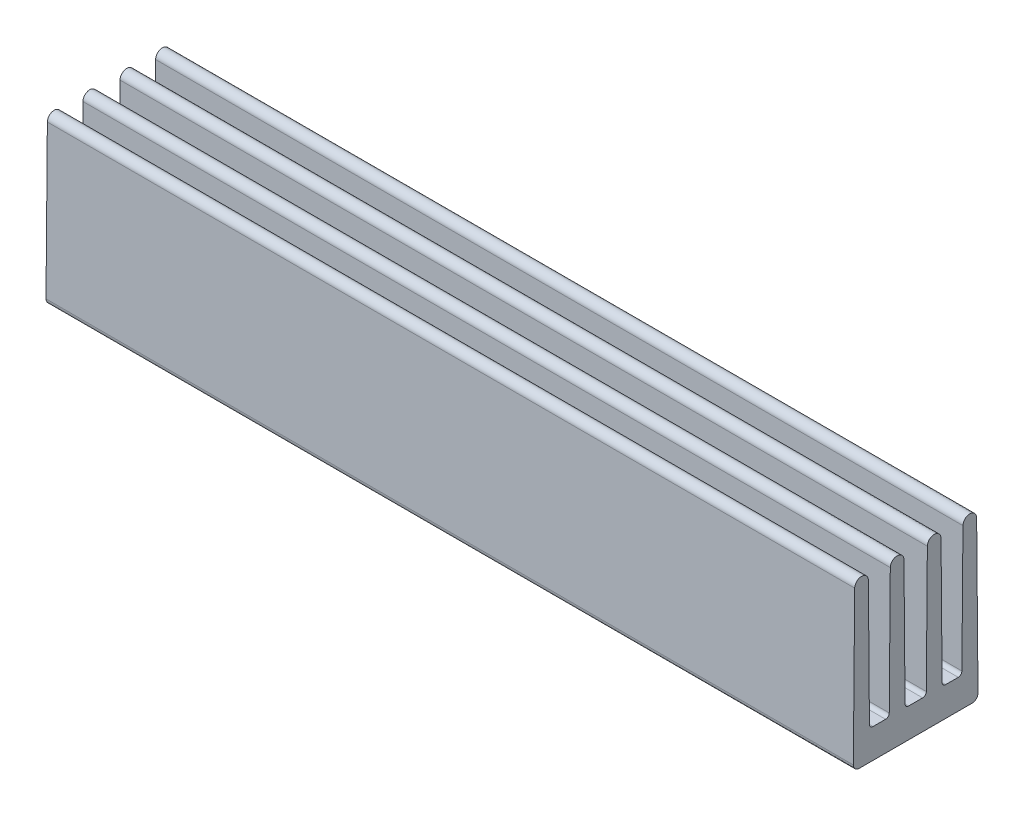
ISO-10303-21;
HEADER;
FILE_DESCRIPTION(('STEP AP214'),'2;1');
FILE_NAME('part.step','',(''),(''),'','','');
FILE_SCHEMA(('AUTOMOTIVE_DESIGN { 1 0 10303 214 1 1 1 1 }'));
ENDSEC;
DATA;
#1=APPLICATION_CONTEXT('core data for automotive mechanical design processes');
#2=APPLICATION_PROTOCOL_DEFINITION('international standard','automotive_design',2000,#1);
#3=PRODUCT_CONTEXT('',#1,'mechanical');
#4=PRODUCT('Part','Part','',(#3));
#5=PRODUCT_RELATED_PRODUCT_CATEGORY('part','',(#4));
#6=PRODUCT_DEFINITION_FORMATION('','',#4);
#7=PRODUCT_DEFINITION_CONTEXT('part definition',#1,'design');
#8=PRODUCT_DEFINITION('design','',#6,#7);
#9=PRODUCT_DEFINITION_SHAPE('','',#8);
#10=(LENGTH_UNIT() NAMED_UNIT(*) SI_UNIT(.MILLI.,.METRE.));
#11=(NAMED_UNIT(*) PLANE_ANGLE_UNIT() SI_UNIT($,.RADIAN.));
#12=(NAMED_UNIT(*) SI_UNIT($,.STERADIAN.) SOLID_ANGLE_UNIT());
#13=UNCERTAINTY_MEASURE_WITH_UNIT(LENGTH_MEASURE(1.E-05),#10,'distance_accuracy_value','');
#14=(GEOMETRIC_REPRESENTATION_CONTEXT(3) GLOBAL_UNCERTAINTY_ASSIGNED_CONTEXT((#13)) GLOBAL_UNIT_ASSIGNED_CONTEXT((#10,
#11,#12)) REPRESENTATION_CONTEXT('',''));
#15=CARTESIAN_POINT('',(0.,0.,0.));
#16=DIRECTION('',(0.,0.,1.));
#17=DIRECTION('',(1.,0.,0.));
#18=AXIS2_PLACEMENT_3D('',#15,#16,#17);
#19=CARTESIAN_POINT('',(27.5,10.7835006819347,-3.68762891330107));
#20=DIRECTION('',(1.,0.,0.));
#21=DIRECTION('',(0.,0.,-1.));
#22=AXIS2_PLACEMENT_3D('',#19,#20,#21);
#23=CYLINDRICAL_SURFACE('',#22,0.466499318065294);
#24=DIRECTION('',(1.,0.,0.));
#25=VECTOR('',#24,1.);
#26=CARTESIAN_POINT('',(-27.5,10.7873871419348,-3.22114578479153));
#27=LINE('',#26,#25);
#28=CARTESIAN_POINT('',(27.5,10.7873871419348,-3.22114578479153));
#29=VERTEX_POINT('',#28);
#30=CARTESIAN_POINT('',(-27.5,10.7873871419348,-3.22114578479153));
#31=VERTEX_POINT('',#30);
#32=EDGE_CURVE('E373',#29,#31,#27,.F.);
#33=ORIENTED_EDGE('',*,*,#32,.F.);
#34=CARTESIAN_POINT('',(27.5,10.7835006819347,-3.68762891330107));
#35=DIRECTION('',(1.,0.,0.));
#36=DIRECTION('',(0.,0.,-1.));
#37=AXIS2_PLACEMENT_3D('',#34,#35,#36);
#38=CIRCLE('',#37,0.466499318065294);
#39=CARTESIAN_POINT('',(27.5,10.7876471787307,-4.15410980285573));
#40=VERTEX_POINT('',#39);
#41=EDGE_CURVE('E379',#40,#29,#38,.T.);
#42=ORIENTED_EDGE('',*,*,#41,.F.);
#43=DIRECTION('',(1.,0.,0.));
#44=VECTOR('',#43,1.);
#45=CARTESIAN_POINT('',(27.5,10.7876471787307,-4.15410980285573));
#46=LINE('',#45,#44);
#47=CARTESIAN_POINT('',(-27.5,10.7876471787307,-4.15410980285573));
#48=VERTEX_POINT('',#47);
#49=EDGE_CURVE('E376',#48,#40,#46,.T.);
#50=ORIENTED_EDGE('',*,*,#49,.F.);
#51=CARTESIAN_POINT('',(-27.5,10.7835006819347,-3.68762891330107));
#52=DIRECTION('',(1.,0.,0.));
#53=DIRECTION('',(0.,0.,-1.));
#54=AXIS2_PLACEMENT_3D('',#51,#52,#53);
#55=CIRCLE('',#54,0.466499318065294);
#56=EDGE_CURVE('E381',#31,#48,#55,.F.);
#57=ORIENTED_EDGE('',*,*,#56,.F.);
#58=EDGE_LOOP('',(#33,#42,#50,#57));
#59=FACE_BOUND('',#58,.T.);
#60=ADVANCED_FACE('F46',(#59),#23,.T.);
#61=CARTESIAN_POINT('',(27.5,10.7836306737387,-1.2625));
#62=DIRECTION('',(1.,0.,0.));
#63=DIRECTION('',(0.,0.,-1.));
#64=AXIS2_PLACEMENT_3D('',#61,#62,#63);
#65=CYLINDRICAL_SURFACE('',#64,0.466369326261257);
#66=DIRECTION('',(1.,0.,0.));
#67=VECTOR('',#66,1.);
#68=CARTESIAN_POINT('',(-27.5,10.787516050762,-0.796146858783211));
#69=LINE('',#68,#67);
#70=CARTESIAN_POINT('',(27.5,10.787516050762,-0.796146858783211));
#71=VERTEX_POINT('',#70);
#72=CARTESIAN_POINT('',(-27.5,10.787516050762,-0.796146858783211));
#73=VERTEX_POINT('',#72);
#74=EDGE_CURVE('E363',#71,#73,#69,.F.);
#75=ORIENTED_EDGE('',*,*,#74,.F.);
#76=CARTESIAN_POINT('',(27.5,10.7836306737387,-1.2625));
#77=DIRECTION('',(1.,0.,0.));
#78=DIRECTION('',(0.,0.,-1.));
#79=AXIS2_PLACEMENT_3D('',#76,#77,#78);
#80=CIRCLE('',#79,0.466369326261257);
#81=CARTESIAN_POINT('',(27.5,10.787516050762,-1.72885314121679));
#82=VERTEX_POINT('',#81);
#83=EDGE_CURVE('E369',#82,#71,#80,.T.);
#84=ORIENTED_EDGE('',*,*,#83,.F.);
#85=DIRECTION('',(1.,0.,0.));
#86=VECTOR('',#85,1.);
#87=CARTESIAN_POINT('',(-27.5,10.787516050762,-1.72885314121679));
#88=LINE('',#87,#86);
#89=CARTESIAN_POINT('',(-27.5,10.787516050762,-1.72885314121679));
#90=VERTEX_POINT('',#89);
#91=EDGE_CURVE('E366',#90,#82,#88,.T.);
#92=ORIENTED_EDGE('',*,*,#91,.F.);
#93=CARTESIAN_POINT('',(-27.5,10.7836306737387,-1.2625));
#94=DIRECTION('',(1.,0.,0.));
#95=DIRECTION('',(0.,0.,-1.));
#96=AXIS2_PLACEMENT_3D('',#93,#94,#95);
#97=CIRCLE('',#96,0.466369326261257);
#98=EDGE_CURVE('E371',#73,#90,#97,.F.);
#99=ORIENTED_EDGE('',*,*,#98,.F.);
#100=EDGE_LOOP('',(#75,#84,#92,#99));
#101=FACE_BOUND('',#100,.T.);
#102=ADVANCED_FACE('F466',(#101),#65,.T.);
#103=CARTESIAN_POINT('',(27.5,10.7836306737387,1.2625));
#104=DIRECTION('',(1.,0.,0.));
#105=DIRECTION('',(0.,0.,-1.));
#106=AXIS2_PLACEMENT_3D('',#103,#104,#105);
#107=CYLINDRICAL_SURFACE('',#106,0.466369326261258);
#108=DIRECTION('',(1.,0.,0.));
#109=VECTOR('',#108,1.);
#110=CARTESIAN_POINT('',(-27.5,10.787516050762,1.72885314121679));
#111=LINE('',#110,#109);
#112=CARTESIAN_POINT('',(27.5,10.787516050762,1.72885314121679));
#113=VERTEX_POINT('',#112);
#114=CARTESIAN_POINT('',(-27.5,10.787516050762,1.72885314121679));
#115=VERTEX_POINT('',#114);
#116=EDGE_CURVE('E353',#113,#115,#111,.F.);
#117=ORIENTED_EDGE('',*,*,#116,.F.);
#118=CARTESIAN_POINT('',(27.5,10.7836306737387,1.2625));
#119=DIRECTION('',(1.,0.,0.));
#120=DIRECTION('',(0.,0.,-1.));
#121=AXIS2_PLACEMENT_3D('',#118,#119,#120);
#122=CIRCLE('',#121,0.466369326261258);
#123=CARTESIAN_POINT('',(27.5,10.787516050762,0.796146858783211));
#124=VERTEX_POINT('',#123);
#125=EDGE_CURVE('E359',#124,#113,#122,.T.);
#126=ORIENTED_EDGE('',*,*,#125,.F.);
#127=DIRECTION('',(1.,0.,0.));
#128=VECTOR('',#127,1.);
#129=CARTESIAN_POINT('',(-27.5,10.787516050762,0.796146858783211));
#130=LINE('',#129,#128);
#131=CARTESIAN_POINT('',(-27.5,10.787516050762,0.796146858783211));
#132=VERTEX_POINT('',#131);
#133=EDGE_CURVE('E356',#132,#124,#130,.T.);
#134=ORIENTED_EDGE('',*,*,#133,.F.);
#135=CARTESIAN_POINT('',(-27.5,10.7836306737387,1.2625));
#136=DIRECTION('',(1.,0.,0.));
#137=DIRECTION('',(0.,0.,-1.));
#138=AXIS2_PLACEMENT_3D('',#135,#136,#137);
#139=CIRCLE('',#138,0.466369326261258);
#140=EDGE_CURVE('E361',#115,#132,#139,.F.);
#141=ORIENTED_EDGE('',*,*,#140,.F.);
#142=EDGE_LOOP('',(#117,#126,#134,#141));
#143=FACE_BOUND('',#142,.T.);
#144=ADVANCED_FACE('F441',(#143),#107,.T.);
#145=CARTESIAN_POINT('',(27.5,10.7835006819347,3.68762891330107));
#146=DIRECTION('',(-1.,0.,0.));
#147=DIRECTION('',(0.,0.,1.));
#148=AXIS2_PLACEMENT_3D('',#145,#146,#147);
#149=CYLINDRICAL_SURFACE('',#148,0.466499318065293);
#150=DIRECTION('',(-1.,0.,0.));
#151=VECTOR('',#150,1.);
#152=CARTESIAN_POINT('',(27.5,10.7876471787307,4.15410980285573));
#153=LINE('',#152,#151);
#154=CARTESIAN_POINT('',(27.5,10.7876471787307,4.15410980285573));
#155=VERTEX_POINT('',#154);
#156=CARTESIAN_POINT('',(-27.5,10.7876471787307,4.15410980285573));
#157=VERTEX_POINT('',#156);
#158=EDGE_CURVE('E339',#155,#157,#153,.T.);
#159=ORIENTED_EDGE('',*,*,#158,.F.);
#160=CARTESIAN_POINT('',(27.5,10.7835006819347,3.68762891330107));
#161=DIRECTION('',(1.,0.,0.));
#162=DIRECTION('',(0.,0.,-1.));
#163=AXIS2_PLACEMENT_3D('',#160,#161,#162);
#164=CIRCLE('',#163,0.466499318065293);
#165=CARTESIAN_POINT('',(27.5,10.7873871419348,3.22114578479153));
#166=VERTEX_POINT('',#165);
#167=EDGE_CURVE('E349',#166,#155,#164,.T.);
#168=ORIENTED_EDGE('',*,*,#167,.F.);
#169=DIRECTION('',(-1.,0.,0.));
#170=VECTOR('',#169,1.);
#171=CARTESIAN_POINT('',(-27.5,10.7873871419348,3.22114578479153));
#172=LINE('',#171,#170);
#173=CARTESIAN_POINT('',(-27.5,10.7873871419348,3.22114578479153));
#174=VERTEX_POINT('',#173);
#175=EDGE_CURVE('E346',#174,#166,#172,.F.);
#176=ORIENTED_EDGE('',*,*,#175,.F.);
#177=CARTESIAN_POINT('',(-27.5,10.7835006819347,3.68762891330107));
#178=DIRECTION('',(1.,0.,0.));
#179=DIRECTION('',(0.,0.,-1.));
#180=AXIS2_PLACEMENT_3D('',#177,#178,#179);
#181=CIRCLE('',#180,0.466499318065293);
#182=EDGE_CURVE('E351',#157,#174,#181,.F.);
#183=ORIENTED_EDGE('',*,*,#182,.F.);
#184=EDGE_LOOP('',(#159,#168,#176,#183));
#185=FACE_BOUND('',#184,.T.);
#186=ADVANCED_FACE('F416',(#185),#149,.T.);
#187=CARTESIAN_POINT('',(27.5,11.25,4.15));
#188=DIRECTION('',(0.,-0.00888853774371659,-0.999960496168113));
#189=DIRECTION('',(0.,0.999960496168113,-0.00888853774371659));
#190=AXIS2_PLACEMENT_3D('',#187,#188,#189);
#191=PLANE('',#190);
#192=DIRECTION('',(0.,-0.999960496168113,0.00888853774371659));
#193=VECTOR('',#192,1.);
#194=CARTESIAN_POINT('',(-27.5,11.25,4.15));
#195=LINE('',#194,#193);
#196=CARTESIAN_POINT('',(-27.5,0.403555415097484,4.24641284075469));
#197=VERTEX_POINT('',#196);
#198=EDGE_CURVE('E325',#157,#197,#195,.T.);
#199=ORIENTED_EDGE('',*,*,#198,.T.);
#200=DIRECTION('',(-1.,0.,0.));
#201=VECTOR('',#200,1.);
#202=CARTESIAN_POINT('',(27.5,0.403555415097486,4.24641284075469));
#203=LINE('',#202,#201);
#204=CARTESIAN_POINT('',(27.5,0.403555415097484,4.24641284075469));
#205=VERTEX_POINT('',#204);
#206=EDGE_CURVE('E12',#197,#205,#203,.F.);
#207=ORIENTED_EDGE('',*,*,#206,.T.);
#208=DIRECTION('',(0.,-0.999960496168113,0.00888853774371659));
#209=VECTOR('',#208,1.);
#210=CARTESIAN_POINT('',(27.5,11.25,4.15));
#211=LINE('',#210,#209);
#212=EDGE_CURVE('E332',#155,#205,#211,.T.);
#213=ORIENTED_EDGE('',*,*,#212,.F.);
#214=ORIENTED_EDGE('',*,*,#158,.T.);
#215=EDGE_LOOP('',(#199,#207,#213,#214));
#216=FACE_BOUND('',#215,.T.);
#217=ADVANCED_FACE('F413',(#216),#191,.F.);
#218=CARTESIAN_POINT('',(27.5,0.,4.25));
#219=DIRECTION('',(0.,1.,0.));
#220=DIRECTION('',(0.,0.,1.));
#221=AXIS2_PLACEMENT_3D('',#218,#219,#220);
#222=PLANE('',#221);
#223=DIRECTION('',(0.,0.,-1.));
#224=VECTOR('',#223,1.);
#225=CARTESIAN_POINT('',(-27.5,0.,4.25));
#226=LINE('',#225,#224);
#227=CARTESIAN_POINT('',(-27.5,0.,3.84642864228744));
#228=VERTEX_POINT('',#227);
#229=CARTESIAN_POINT('',(-27.5,0.,-3.84642864228744));
#230=VERTEX_POINT('',#229);
#231=EDGE_CURVE('E341',#228,#230,#226,.T.);
#232=ORIENTED_EDGE('',*,*,#231,.T.);
#233=DIRECTION('',(-1.,0.,0.));
#234=VECTOR('',#233,1.);
#235=CARTESIAN_POINT('',(27.5,0.,-3.84642864228744));
#236=LINE('',#235,#234);
#237=CARTESIAN_POINT('',(27.5,0.,-3.84642864228744));
#238=VERTEX_POINT('',#237);
#239=EDGE_CURVE('E67',#230,#238,#236,.F.);
#240=ORIENTED_EDGE('',*,*,#239,.T.);
#241=DIRECTION('',(0.,0.,-1.));
#242=VECTOR('',#241,1.);
#243=CARTESIAN_POINT('',(27.5,0.,4.25));
#244=LINE('',#243,#242);
#245=CARTESIAN_POINT('',(27.5,0.,3.84642864228744));
#246=VERTEX_POINT('',#245);
#247=EDGE_CURVE('E334',#246,#238,#244,.T.);
#248=ORIENTED_EDGE('',*,*,#247,.F.);
#249=DIRECTION('',(-1.,0.,0.));
#250=VECTOR('',#249,1.);
#251=CARTESIAN_POINT('',(27.5,0.,3.84642864228744));
#252=LINE('',#251,#250);
#253=EDGE_CURVE('E391',#246,#228,#252,.T.);
#254=ORIENTED_EDGE('',*,*,#253,.T.);
#255=EDGE_LOOP('',(#232,#240,#248,#254));
#256=FACE_BOUND('',#255,.T.);
#257=ADVANCED_FACE('F408',(#256),#222,.F.);
#258=CARTESIAN_POINT('',(27.5,0.,-4.25));
#259=DIRECTION('',(0.,-0.00888853774371659,0.999960496168113));
#260=DIRECTION('',(0.,-0.999960496168113,-0.00888853774371659));
#261=AXIS2_PLACEMENT_3D('',#258,#259,#260);
#262=PLANE('',#261);
#263=DIRECTION('',(0.,0.999960496168113,0.00888853774371659));
#264=VECTOR('',#263,1.);
#265=CARTESIAN_POINT('',(27.5,0.,-4.25));
#266=LINE('',#265,#264);
#267=CARTESIAN_POINT('',(27.5,0.403555415097487,-4.24641284075469));
#268=VERTEX_POINT('',#267);
#269=EDGE_CURVE('E337',#268,#40,#266,.T.);
#270=ORIENTED_EDGE('',*,*,#269,.F.);
#271=DIRECTION('',(-1.,0.,0.));
#272=VECTOR('',#271,1.);
#273=CARTESIAN_POINT('',(27.5,0.403555415097487,-4.24641284075469));
#274=LINE('',#273,#272);
#275=CARTESIAN_POINT('',(-27.5,0.403555415097487,-4.24641284075469));
#276=VERTEX_POINT('',#275);
#277=EDGE_CURVE('E384',#268,#276,#274,.T.);
#278=ORIENTED_EDGE('',*,*,#277,.T.);
#279=DIRECTION('',(0.,0.999960496168113,0.00888853774371659));
#280=VECTOR('',#279,1.);
#281=CARTESIAN_POINT('',(-27.5,0.,-4.25));
#282=LINE('',#281,#280);
#283=EDGE_CURVE('E335',#276,#48,#282,.T.);
#284=ORIENTED_EDGE('',*,*,#283,.T.);
#285=ORIENTED_EDGE('',*,*,#49,.T.);
#286=EDGE_LOOP('',(#270,#278,#284,#285));
#287=FACE_BOUND('',#286,.T.);
#288=ADVANCED_FACE('F404',(#287),#262,.F.);
#289=CARTESIAN_POINT('',(27.5,0.,0.));
#290=DIRECTION('',(1.,0.,0.));
#291=DIRECTION('',(0.,0.,-1.));
#292=AXIS2_PLACEMENT_3D('',#289,#290,#291);
#293=PLANE('',#292);
#294=ORIENTED_EDGE('',*,*,#247,.T.);
#295=CARTESIAN_POINT('',(27.5,0.4,-3.84642864228744));
#296=DIRECTION('',(1.,0.,0.));
#297=DIRECTION('',(0.,0.,-1.));
#298=AXIS2_PLACEMENT_3D('',#295,#296,#297);
#299=CIRCLE('',#298,0.4);
#300=EDGE_CURVE('E54',#238,#268,#299,.T.);
#301=ORIENTED_EDGE('',*,*,#300,.T.);
#302=ORIENTED_EDGE('',*,*,#269,.T.);
#303=ORIENTED_EDGE('',*,*,#41,.T.);
#304=DIRECTION('',(0.,0.999965295649698,-0.00833111614440842));
#305=VECTOR('',#304,1.);
#306=CARTESIAN_POINT('',(27.5,2.2479172209639,-3.15));
#307=LINE('',#306,#305);
#308=CARTESIAN_POINT('',(27.5,2.2479172209639,-3.15));
#309=VERTEX_POINT('',#308);
#310=EDGE_CURVE('E242',#309,#29,#307,.T.);
#311=ORIENTED_EDGE('',*,*,#310,.F.);
#312=CARTESIAN_POINT('',(27.5,2.25,-2.90000867608757));
#313=DIRECTION('',(1.,0.,0.));
#314=DIRECTION('',(0.,0.,-1.));
#315=AXIS2_PLACEMENT_3D('',#312,#313,#314);
#316=CIRCLE('',#315,0.25);
#317=CARTESIAN_POINT('',(27.5,2.,-2.90000867608757));
#318=VERTEX_POINT('',#317);
#319=EDGE_CURVE('E250',#318,#309,#316,.T.);
#320=ORIENTED_EDGE('',*,*,#319,.F.);
#321=DIRECTION('',(0.,0.,-1.));
#322=VECTOR('',#321,1.);
#323=CARTESIAN_POINT('',(27.5,2.,-2.04999132391243));
#324=LINE('',#323,#322);
#325=CARTESIAN_POINT('',(27.5,2.,-2.04999132391243));
#326=VERTEX_POINT('',#325);
#327=EDGE_CURVE('E248',#326,#318,#324,.T.);
#328=ORIENTED_EDGE('',*,*,#327,.F.);
#329=CARTESIAN_POINT('',(27.5,2.25,-2.04999132391243));
#330=DIRECTION('',(1.,0.,0.));
#331=DIRECTION('',(0.,0.,-1.));
#332=AXIS2_PLACEMENT_3D('',#329,#330,#331);
#333=CIRCLE('',#332,0.25);
#334=CARTESIAN_POINT('',(27.5,2.2479172209639,-1.8));
#335=VERTEX_POINT('',#334);
#336=EDGE_CURVE('E217',#335,#326,#333,.T.);
#337=ORIENTED_EDGE('',*,*,#336,.F.);
#338=DIRECTION('',(0.,-0.999965295649698,-0.00833111614440842));
#339=VECTOR('',#338,1.);
#340=CARTESIAN_POINT('',(27.5,11.25,-1.725));
#341=LINE('',#340,#339);
#342=EDGE_CURVE('E245',#82,#335,#341,.T.);
#343=ORIENTED_EDGE('',*,*,#342,.F.);
#344=ORIENTED_EDGE('',*,*,#83,.T.);
#345=DIRECTION('',(0.,0.999965295649698,-0.0083311161444083));
#346=VECTOR('',#345,1.);
#347=CARTESIAN_POINT('',(27.5,2.2479172209639,-0.725));
#348=LINE('',#347,#346);
#349=CARTESIAN_POINT('',(27.5,2.2479172209639,-0.725));
#350=VERTEX_POINT('',#349);
#351=EDGE_CURVE('E298',#350,#71,#348,.T.);
#352=ORIENTED_EDGE('',*,*,#351,.F.);
#353=CARTESIAN_POINT('',(27.5,2.25,-0.475008676087575));
#354=DIRECTION('',(1.,0.,0.));
#355=DIRECTION('',(0.,0.,-1.));
#356=AXIS2_PLACEMENT_3D('',#353,#354,#355);
#357=CIRCLE('',#356,0.25);
#358=CARTESIAN_POINT('',(27.5,2.,-0.475008676087575));
#359=VERTEX_POINT('',#358);
#360=EDGE_CURVE('E318',#359,#350,#357,.T.);
#361=ORIENTED_EDGE('',*,*,#360,.F.);
#362=DIRECTION('',(0.,0.,-1.));
#363=VECTOR('',#362,1.);
#364=CARTESIAN_POINT('',(27.5,2.,0.475008676087575));
#365=LINE('',#364,#363);
#366=CARTESIAN_POINT('',(27.5,2.,0.475008676087575));
#367=VERTEX_POINT('',#366);
#368=EDGE_CURVE('E315',#367,#359,#365,.T.);
#369=ORIENTED_EDGE('',*,*,#368,.F.);
#370=CARTESIAN_POINT('',(27.5,2.25,0.475008676087575));
#371=DIRECTION('',(1.,0.,0.));
#372=DIRECTION('',(0.,0.,-1.));
#373=AXIS2_PLACEMENT_3D('',#370,#371,#372);
#374=CIRCLE('',#373,0.25);
#375=CARTESIAN_POINT('',(27.5,2.2479172209639,0.725));
#376=VERTEX_POINT('',#375);
#377=EDGE_CURVE('E312',#376,#367,#374,.T.);
#378=ORIENTED_EDGE('',*,*,#377,.F.);
#379=DIRECTION('',(0.,-0.999965295649698,-0.00833111614440827));
#380=VECTOR('',#379,1.);
#381=CARTESIAN_POINT('',(27.5,11.25,0.8));
#382=LINE('',#381,#380);
#383=EDGE_CURVE('E288',#124,#376,#382,.T.);
#384=ORIENTED_EDGE('',*,*,#383,.F.);
#385=ORIENTED_EDGE('',*,*,#125,.T.);
#386=DIRECTION('',(0.,0.999965295649698,-0.00833111614440842));
#387=VECTOR('',#386,1.);
#388=CARTESIAN_POINT('',(27.5,11.25,1.725));
#389=LINE('',#388,#387);
#390=CARTESIAN_POINT('',(27.5,2.2479172209639,1.8));
#391=VERTEX_POINT('',#390);
#392=EDGE_CURVE('E261',#391,#113,#389,.T.);
#393=ORIENTED_EDGE('',*,*,#392,.F.);
#394=CARTESIAN_POINT('',(27.5,2.25,2.04999132391243));
#395=DIRECTION('',(1.,0.,0.));
#396=DIRECTION('',(0.,0.,1.));
#397=AXIS2_PLACEMENT_3D('',#394,#395,#396);
#398=CIRCLE('',#397,0.25);
#399=CARTESIAN_POINT('',(27.5,2.,2.04999132391243));
#400=VERTEX_POINT('',#399);
#401=EDGE_CURVE('E281',#400,#391,#398,.T.);
#402=ORIENTED_EDGE('',*,*,#401,.F.);
#403=DIRECTION('',(0.,0.,-1.));
#404=VECTOR('',#403,1.);
#405=CARTESIAN_POINT('',(27.5,2.,2.04999132391243));
#406=LINE('',#405,#404);
#407=CARTESIAN_POINT('',(27.5,2.,2.90000867608757));
#408=VERTEX_POINT('',#407);
#409=EDGE_CURVE('E278',#408,#400,#406,.T.);
#410=ORIENTED_EDGE('',*,*,#409,.F.);
#411=CARTESIAN_POINT('',(27.5,2.25,2.90000867608757));
#412=DIRECTION('',(1.,0.,0.));
#413=DIRECTION('',(0.,0.,1.));
#414=AXIS2_PLACEMENT_3D('',#411,#412,#413);
#415=CIRCLE('',#414,0.25);
#416=CARTESIAN_POINT('',(27.5,2.2479172209639,3.15));
#417=VERTEX_POINT('',#416);
#418=EDGE_CURVE('E275',#417,#408,#415,.T.);
#419=ORIENTED_EDGE('',*,*,#418,.F.);
#420=DIRECTION('',(0.,-0.999965295649698,-0.00833111614440842));
#421=VECTOR('',#420,1.);
#422=CARTESIAN_POINT('',(27.5,2.2479172209639,3.15));
#423=LINE('',#422,#421);
#424=EDGE_CURVE('E255',#166,#417,#423,.T.);
#425=ORIENTED_EDGE('',*,*,#424,.F.);
#426=ORIENTED_EDGE('',*,*,#167,.T.);
#427=ORIENTED_EDGE('',*,*,#212,.T.);
#428=CARTESIAN_POINT('',(27.5,0.4,3.84642864228744));
#429=DIRECTION('',(1.,0.,0.));
#430=DIRECTION('',(0.,0.,-1.));
#431=AXIS2_PLACEMENT_3D('',#428,#429,#430);
#432=CIRCLE('',#431,0.4);
#433=EDGE_CURVE('E395',#205,#246,#432,.T.);
#434=ORIENTED_EDGE('',*,*,#433,.T.);
#435=EDGE_LOOP('',(#294,#301,#302,#303,#311,#320,#328,#337,#343,#344,#352,#361,#369,#378,#384,
#385,#393,#402,#410,#419,#425,#426,#427,#434));
#436=FACE_BOUND('',#435,.T.);
#437=ADVANCED_FACE('F399',(#436),#293,.T.);
#438=CARTESIAN_POINT('',(-27.5,0.,0.));
#439=DIRECTION('',(1.,0.,0.));
#440=DIRECTION('',(0.,0.,-1.));
#441=AXIS2_PLACEMENT_3D('',#438,#439,#440);
#442=PLANE('',#441);
#443=ORIENTED_EDGE('',*,*,#283,.F.);
#444=CARTESIAN_POINT('',(-27.5,0.4,-3.84642864228744));
#445=DIRECTION('',(1.,0.,0.));
#446=DIRECTION('',(0.,0.,-1.));
#447=AXIS2_PLACEMENT_3D('',#444,#445,#446);
#448=CIRCLE('',#447,0.4);
#449=EDGE_CURVE('E389',#276,#230,#448,.F.);
#450=ORIENTED_EDGE('',*,*,#449,.T.);
#451=ORIENTED_EDGE('',*,*,#231,.F.);
#452=CARTESIAN_POINT('',(-27.5,0.4,3.84642864228744));
#453=DIRECTION('',(1.,0.,0.));
#454=DIRECTION('',(0.,0.,-1.));
#455=AXIS2_PLACEMENT_3D('',#452,#453,#454);
#456=CIRCLE('',#455,0.4);
#457=EDGE_CURVE('E387',#228,#197,#456,.F.);
#458=ORIENTED_EDGE('',*,*,#457,.T.);
#459=ORIENTED_EDGE('',*,*,#198,.F.);
#460=ORIENTED_EDGE('',*,*,#182,.T.);
#461=DIRECTION('',(0.,-0.999965295649698,-0.00833111614440842));
#462=VECTOR('',#461,1.);
#463=CARTESIAN_POINT('',(-27.5,2.2479172209639,3.15));
#464=LINE('',#463,#462);
#465=CARTESIAN_POINT('',(-27.5,2.2479172209639,3.15));
#466=VERTEX_POINT('',#465);
#467=EDGE_CURVE('E258',#174,#466,#464,.T.);
#468=ORIENTED_EDGE('',*,*,#467,.T.);
#469=CARTESIAN_POINT('',(-27.5,2.25,2.90000867608757));
#470=DIRECTION('',(1.,0.,0.));
#471=DIRECTION('',(0.,0.,1.));
#472=AXIS2_PLACEMENT_3D('',#469,#470,#471);
#473=CIRCLE('',#472,0.25);
#474=CARTESIAN_POINT('',(-27.5,2.,2.90000867608757));
#475=VERTEX_POINT('',#474);
#476=EDGE_CURVE('E260',#466,#475,#473,.T.);
#477=ORIENTED_EDGE('',*,*,#476,.T.);
#478=DIRECTION('',(0.,0.,-1.));
#479=VECTOR('',#478,1.);
#480=CARTESIAN_POINT('',(-27.5,2.,2.04999132391243));
#481=LINE('',#480,#479);
#482=CARTESIAN_POINT('',(-27.5,2.,2.04999132391243));
#483=VERTEX_POINT('',#482);
#484=EDGE_CURVE('E264',#475,#483,#481,.T.);
#485=ORIENTED_EDGE('',*,*,#484,.T.);
#486=CARTESIAN_POINT('',(-27.5,2.25,2.04999132391243));
#487=DIRECTION('',(1.,0.,0.));
#488=DIRECTION('',(0.,0.,1.));
#489=AXIS2_PLACEMENT_3D('',#486,#487,#488);
#490=CIRCLE('',#489,0.25);
#491=CARTESIAN_POINT('',(-27.5,2.2479172209639,1.8));
#492=VERTEX_POINT('',#491);
#493=EDGE_CURVE('E267',#483,#492,#490,.T.);
#494=ORIENTED_EDGE('',*,*,#493,.T.);
#495=DIRECTION('',(0.,0.999965295649698,-0.00833111614440842));
#496=VECTOR('',#495,1.);
#497=CARTESIAN_POINT('',(-27.5,11.25,1.725));
#498=LINE('',#497,#496);
#499=EDGE_CURVE('E270',#492,#115,#498,.T.);
#500=ORIENTED_EDGE('',*,*,#499,.T.);
#501=ORIENTED_EDGE('',*,*,#140,.T.);
#502=DIRECTION('',(0.,-0.999965295649698,-0.00833111614440827));
#503=VECTOR('',#502,1.);
#504=CARTESIAN_POINT('',(-27.5,11.25,0.8));
#505=LINE('',#504,#503);
#506=CARTESIAN_POINT('',(-27.5,2.2479172209639,0.725));
#507=VERTEX_POINT('',#506);
#508=EDGE_CURVE('E295',#132,#507,#505,.T.);
#509=ORIENTED_EDGE('',*,*,#508,.T.);
#510=CARTESIAN_POINT('',(-27.5,2.25,0.475008676087575));
#511=DIRECTION('',(1.,0.,0.));
#512=DIRECTION('',(0.,0.,-1.));
#513=AXIS2_PLACEMENT_3D('',#510,#511,#512);
#514=CIRCLE('',#513,0.25);
#515=CARTESIAN_POINT('',(-27.5,2.,0.475008676087575));
#516=VERTEX_POINT('',#515);
#517=EDGE_CURVE('E297',#507,#516,#514,.T.);
#518=ORIENTED_EDGE('',*,*,#517,.T.);
#519=DIRECTION('',(0.,0.,-1.));
#520=VECTOR('',#519,1.);
#521=CARTESIAN_POINT('',(-27.5,2.,0.475008676087575));
#522=LINE('',#521,#520);
#523=CARTESIAN_POINT('',(-27.5,2.,-0.475008676087575));
#524=VERTEX_POINT('',#523);
#525=EDGE_CURVE('E301',#516,#524,#522,.T.);
#526=ORIENTED_EDGE('',*,*,#525,.T.);
#527=CARTESIAN_POINT('',(-27.5,2.25,-0.475008676087575));
#528=DIRECTION('',(1.,0.,0.));
#529=DIRECTION('',(0.,0.,-1.));
#530=AXIS2_PLACEMENT_3D('',#527,#528,#529);
#531=CIRCLE('',#530,0.25);
#532=CARTESIAN_POINT('',(-27.5,2.2479172209639,-0.725));
#533=VERTEX_POINT('',#532);
#534=EDGE_CURVE('E304',#524,#533,#531,.T.);
#535=ORIENTED_EDGE('',*,*,#534,.T.);
#536=DIRECTION('',(0.,0.999965295649698,-0.0083311161444083));
#537=VECTOR('',#536,1.);
#538=CARTESIAN_POINT('',(-27.5,2.2479172209639,-0.725));
#539=LINE('',#538,#537);
#540=EDGE_CURVE('E307',#533,#73,#539,.T.);
#541=ORIENTED_EDGE('',*,*,#540,.T.);
#542=ORIENTED_EDGE('',*,*,#98,.T.);
#543=DIRECTION('',(0.,-0.999965295649698,-0.00833111614440842));
#544=VECTOR('',#543,1.);
#545=CARTESIAN_POINT('',(-27.5,11.25,-1.725));
#546=LINE('',#545,#544);
#547=CARTESIAN_POINT('',(-27.5,2.2479172209639,-1.8));
#548=VERTEX_POINT('',#547);
#549=EDGE_CURVE('E235',#90,#548,#546,.T.);
#550=ORIENTED_EDGE('',*,*,#549,.T.);
#551=CARTESIAN_POINT('',(-27.5,2.25,-2.04999132391243));
#552=DIRECTION('',(1.,0.,0.));
#553=DIRECTION('',(0.,0.,-1.));
#554=AXIS2_PLACEMENT_3D('',#551,#552,#553);
#555=CIRCLE('',#554,0.25);
#556=CARTESIAN_POINT('',(-27.5,2.,-2.04999132391243));
#557=VERTEX_POINT('',#556);
#558=EDGE_CURVE('E214',#548,#557,#555,.T.);
#559=ORIENTED_EDGE('',*,*,#558,.T.);
#560=DIRECTION('',(0.,0.,-1.));
#561=VECTOR('',#560,1.);
#562=CARTESIAN_POINT('',(-27.5,2.,-2.04999132391243));
#563=LINE('',#562,#561);
#564=CARTESIAN_POINT('',(-27.5,2.,-2.90000867608757));
#565=VERTEX_POINT('',#564);
#566=EDGE_CURVE('E225',#557,#565,#563,.T.);
#567=ORIENTED_EDGE('',*,*,#566,.T.);
#568=CARTESIAN_POINT('',(-27.5,2.25,-2.90000867608757));
#569=DIRECTION('',(1.,0.,0.));
#570=DIRECTION('',(0.,0.,-1.));
#571=AXIS2_PLACEMENT_3D('',#568,#569,#570);
#572=CIRCLE('',#571,0.25);
#573=CARTESIAN_POINT('',(-27.5,2.2479172209639,-3.15));
#574=VERTEX_POINT('',#573);
#575=EDGE_CURVE('E230',#565,#574,#572,.T.);
#576=ORIENTED_EDGE('',*,*,#575,.T.);
#577=DIRECTION('',(0.,0.999965295649698,-0.00833111614440842));
#578=VECTOR('',#577,1.);
#579=CARTESIAN_POINT('',(-27.5,2.2479172209639,-3.15));
#580=LINE('',#579,#578);
#581=EDGE_CURVE('E237',#574,#31,#580,.T.);
#582=ORIENTED_EDGE('',*,*,#581,.T.);
#583=ORIENTED_EDGE('',*,*,#56,.T.);
#584=EDGE_LOOP('',(#443,#450,#451,#458,#459,#460,#468,#477,#485,#494,#500,#501,#509,#518,#526,
#535,#541,#542,#550,#559,#567,#576,#582,#583));
#585=FACE_BOUND('',#584,.T.);
#586=ADVANCED_FACE('F233',(#585),#442,.F.);
#587=CARTESIAN_POINT('',(-27.5,2.2479172209639,-0.725));
#588=DIRECTION('',(0.,-0.0083311161444083,-0.999965295649698));
#589=DIRECTION('',(0.,0.999965295649698,-0.0083311161444083));
#590=AXIS2_PLACEMENT_3D('',#587,#588,#589);
#591=PLANE('',#590);
#592=ORIENTED_EDGE('',*,*,#351,.T.);
#593=ORIENTED_EDGE('',*,*,#74,.T.);
#594=ORIENTED_EDGE('',*,*,#540,.F.);
#595=DIRECTION('',(1.,0.,0.));
#596=VECTOR('',#595,1.);
#597=CARTESIAN_POINT('',(-27.5,2.2479172209639,-0.725));
#598=LINE('',#597,#596);
#599=EDGE_CURVE('E323',#533,#350,#598,.T.);
#600=ORIENTED_EDGE('',*,*,#599,.T.);
#601=EDGE_LOOP('',(#592,#593,#594,#600));
#602=FACE_BOUND('',#601,.T.);
#603=ADVANCED_FACE('F463',(#602),#591,.F.);
#604=CARTESIAN_POINT('',(-27.5,2.25,-0.475008676087575));
#605=DIRECTION('',(1.,0.,0.));
#606=DIRECTION('',(0.,0.,-1.));
#607=AXIS2_PLACEMENT_3D('',#604,#605,#606);
#608=CYLINDRICAL_SURFACE('',#607,0.25);
#609=ORIENTED_EDGE('',*,*,#360,.T.);
#610=ORIENTED_EDGE('',*,*,#599,.F.);
#611=ORIENTED_EDGE('',*,*,#534,.F.);
#612=DIRECTION('',(1.,0.,0.));
#613=VECTOR('',#612,1.);
#614=CARTESIAN_POINT('',(-27.5,2.,-0.475008676087575));
#615=LINE('',#614,#613);
#616=EDGE_CURVE('E326',#524,#359,#615,.T.);
#617=ORIENTED_EDGE('',*,*,#616,.T.);
#618=EDGE_LOOP('',(#609,#610,#611,#617));
#619=FACE_BOUND('',#618,.T.);
#620=ADVANCED_FACE('F461',(#619),#608,.F.);
#621=CARTESIAN_POINT('',(-27.5,2.,0.475008676087575));
#622=DIRECTION('',(0.,-1.,0.));
#623=DIRECTION('',(0.,0.,-1.));
#624=AXIS2_PLACEMENT_3D('',#621,#622,#623);
#625=PLANE('',#624);
#626=ORIENTED_EDGE('',*,*,#368,.T.);
#627=ORIENTED_EDGE('',*,*,#616,.F.);
#628=ORIENTED_EDGE('',*,*,#525,.F.);
#629=DIRECTION('',(1.,0.,0.));
#630=VECTOR('',#629,1.);
#631=CARTESIAN_POINT('',(-27.5,2.,0.475008676087575));
#632=LINE('',#631,#630);
#633=EDGE_CURVE('E328',#516,#367,#632,.T.);
#634=ORIENTED_EDGE('',*,*,#633,.T.);
#635=EDGE_LOOP('',(#626,#627,#628,#634));
#636=FACE_BOUND('',#635,.T.);
#637=ADVANCED_FACE('F457',(#636),#625,.F.);
#638=CARTESIAN_POINT('',(-27.5,2.25,0.475008676087575));
#639=DIRECTION('',(1.,0.,0.));
#640=DIRECTION('',(0.,0.,-1.));
#641=AXIS2_PLACEMENT_3D('',#638,#639,#640);
#642=CYLINDRICAL_SURFACE('',#641,0.25);
#643=ORIENTED_EDGE('',*,*,#377,.T.);
#644=ORIENTED_EDGE('',*,*,#633,.F.);
#645=ORIENTED_EDGE('',*,*,#517,.F.);
#646=DIRECTION('',(1.,0.,0.));
#647=VECTOR('',#646,1.);
#648=CARTESIAN_POINT('',(-27.5,2.2479172209639,0.725));
#649=LINE('',#648,#647);
#650=EDGE_CURVE('E310',#507,#376,#649,.T.);
#651=ORIENTED_EDGE('',*,*,#650,.T.);
#652=EDGE_LOOP('',(#643,#644,#645,#651));
#653=FACE_BOUND('',#652,.T.);
#654=ADVANCED_FACE('F448',(#653),#642,.F.);
#655=CARTESIAN_POINT('',(-27.5,11.25,0.8));
#656=DIRECTION('',(0.,-0.00833111614440827,0.999965295649698));
#657=DIRECTION('',(0.,-0.999965295649698,-0.00833111614440827));
#658=AXIS2_PLACEMENT_3D('',#655,#656,#657);
#659=PLANE('',#658);
#660=ORIENTED_EDGE('',*,*,#508,.F.);
#661=ORIENTED_EDGE('',*,*,#133,.T.);
#662=ORIENTED_EDGE('',*,*,#383,.T.);
#663=ORIENTED_EDGE('',*,*,#650,.F.);
#664=EDGE_LOOP('',(#660,#661,#662,#663));
#665=FACE_BOUND('',#664,.T.);
#666=ADVANCED_FACE('F451',(#665),#659,.F.);
#667=CARTESIAN_POINT('',(-27.5,2.2479172209639,3.15));
#668=DIRECTION('',(0.,-0.00833111614440842,0.999965295649698));
#669=DIRECTION('',(0.,-0.999965295649698,-0.00833111614440842));
#670=AXIS2_PLACEMENT_3D('',#667,#668,#669);
#671=PLANE('',#670);
#672=ORIENTED_EDGE('',*,*,#467,.F.);
#673=ORIENTED_EDGE('',*,*,#175,.T.);
#674=ORIENTED_EDGE('',*,*,#424,.T.);
#675=DIRECTION('',(1.,0.,0.));
#676=VECTOR('',#675,1.);
#677=CARTESIAN_POINT('',(-27.5,2.2479172209639,3.15));
#678=LINE('',#677,#676);
#679=EDGE_CURVE('E273',#466,#417,#678,.T.);
#680=ORIENTED_EDGE('',*,*,#679,.F.);
#681=EDGE_LOOP('',(#672,#673,#674,#680));
#682=FACE_BOUND('',#681,.T.);
#683=ADVANCED_FACE('F422',(#682),#671,.F.);
#684=CARTESIAN_POINT('',(-27.5,11.25,1.725));
#685=DIRECTION('',(0.,-0.00833111614440842,-0.999965295649698));
#686=DIRECTION('',(0.,0.999965295649698,-0.00833111614440842));
#687=AXIS2_PLACEMENT_3D('',#684,#685,#686);
#688=PLANE('',#687);
#689=ORIENTED_EDGE('',*,*,#392,.T.);
#690=ORIENTED_EDGE('',*,*,#116,.T.);
#691=ORIENTED_EDGE('',*,*,#499,.F.);
#692=DIRECTION('',(1.,0.,0.));
#693=VECTOR('',#692,1.);
#694=CARTESIAN_POINT('',(-27.5,2.2479172209639,1.8));
#695=LINE('',#694,#693);
#696=EDGE_CURVE('E286',#492,#391,#695,.T.);
#697=ORIENTED_EDGE('',*,*,#696,.T.);
#698=EDGE_LOOP('',(#689,#690,#691,#697));
#699=FACE_BOUND('',#698,.T.);
#700=ADVANCED_FACE('F438',(#699),#688,.F.);
#701=CARTESIAN_POINT('',(-27.5,2.25,2.04999132391243));
#702=DIRECTION('',(1.,0.,0.));
#703=DIRECTION('',(0.,0.,-1.));
#704=AXIS2_PLACEMENT_3D('',#701,#702,#703);
#705=CYLINDRICAL_SURFACE('',#704,0.25);
#706=ORIENTED_EDGE('',*,*,#401,.T.);
#707=ORIENTED_EDGE('',*,*,#696,.F.);
#708=ORIENTED_EDGE('',*,*,#493,.F.);
#709=DIRECTION('',(1.,0.,0.));
#710=VECTOR('',#709,1.);
#711=CARTESIAN_POINT('',(-27.5,2.,2.04999132391243));
#712=LINE('',#711,#710);
#713=EDGE_CURVE('E289',#483,#400,#712,.T.);
#714=ORIENTED_EDGE('',*,*,#713,.T.);
#715=EDGE_LOOP('',(#706,#707,#708,#714));
#716=FACE_BOUND('',#715,.T.);
#717=ADVANCED_FACE('F435',(#716),#705,.F.);
#718=CARTESIAN_POINT('',(-27.5,2.,2.04999132391243));
#719=DIRECTION('',(0.,-1.,0.));
#720=DIRECTION('',(0.,0.,-1.));
#721=AXIS2_PLACEMENT_3D('',#718,#719,#720);
#722=PLANE('',#721);
#723=ORIENTED_EDGE('',*,*,#409,.T.);
#724=ORIENTED_EDGE('',*,*,#713,.F.);
#725=ORIENTED_EDGE('',*,*,#484,.F.);
#726=DIRECTION('',(1.,0.,0.));
#727=VECTOR('',#726,1.);
#728=CARTESIAN_POINT('',(-27.5,2.,2.90000867608757));
#729=LINE('',#728,#727);
#730=EDGE_CURVE('E291',#475,#408,#729,.T.);
#731=ORIENTED_EDGE('',*,*,#730,.T.);
#732=EDGE_LOOP('',(#723,#724,#725,#731));
#733=FACE_BOUND('',#732,.T.);
#734=ADVANCED_FACE('F430',(#733),#722,.F.);
#735=CARTESIAN_POINT('',(-27.5,2.25,2.90000867608757));
#736=DIRECTION('',(1.,0.,0.));
#737=DIRECTION('',(0.,0.,-1.));
#738=AXIS2_PLACEMENT_3D('',#735,#736,#737);
#739=CYLINDRICAL_SURFACE('',#738,0.25);
#740=ORIENTED_EDGE('',*,*,#418,.T.);
#741=ORIENTED_EDGE('',*,*,#730,.F.);
#742=ORIENTED_EDGE('',*,*,#476,.F.);
#743=ORIENTED_EDGE('',*,*,#679,.T.);
#744=EDGE_LOOP('',(#740,#741,#742,#743));
#745=FACE_BOUND('',#744,.T.);
#746=ADVANCED_FACE('F427',(#745),#739,.F.);
#747=CARTESIAN_POINT('',(-27.5,2.2479172209639,-3.15));
#748=DIRECTION('',(0.,-0.00833111614440842,-0.999965295649698));
#749=DIRECTION('',(0.,0.999965295649698,-0.00833111614440842));
#750=AXIS2_PLACEMENT_3D('',#747,#748,#749);
#751=PLANE('',#750);
#752=ORIENTED_EDGE('',*,*,#310,.T.);
#753=ORIENTED_EDGE('',*,*,#32,.T.);
#754=ORIENTED_EDGE('',*,*,#581,.F.);
#755=DIRECTION('',(1.,0.,0.));
#756=VECTOR('',#755,1.);
#757=CARTESIAN_POINT('',(-27.5,2.2479172209639,-3.15));
#758=LINE('',#757,#756);
#759=EDGE_CURVE('E253',#574,#309,#758,.T.);
#760=ORIENTED_EDGE('',*,*,#759,.T.);
#761=EDGE_LOOP('',(#752,#753,#754,#760));
#762=FACE_BOUND('',#761,.T.);
#763=ADVANCED_FACE('F478',(#762),#751,.F.);
#764=CARTESIAN_POINT('',(-27.5,2.25,-2.90000867608757));
#765=DIRECTION('',(1.,0.,0.));
#766=DIRECTION('',(0.,0.,-1.));
#767=AXIS2_PLACEMENT_3D('',#764,#765,#766);
#768=CYLINDRICAL_SURFACE('',#767,0.25);
#769=ORIENTED_EDGE('',*,*,#319,.T.);
#770=ORIENTED_EDGE('',*,*,#759,.F.);
#771=ORIENTED_EDGE('',*,*,#575,.F.);
#772=DIRECTION('',(1.,0.,0.));
#773=VECTOR('',#772,1.);
#774=CARTESIAN_POINT('',(-27.5,2.,-2.90000867608757));
#775=LINE('',#774,#773);
#776=EDGE_CURVE('E221',#565,#318,#775,.T.);
#777=ORIENTED_EDGE('',*,*,#776,.T.);
#778=EDGE_LOOP('',(#769,#770,#771,#777));
#779=FACE_BOUND('',#778,.T.);
#780=ADVANCED_FACE('F474',(#779),#768,.F.);
#781=CARTESIAN_POINT('',(-27.5,2.,-2.04999132391243));
#782=DIRECTION('',(0.,-1.,0.));
#783=DIRECTION('',(0.,0.,-1.));
#784=AXIS2_PLACEMENT_3D('',#781,#782,#783);
#785=PLANE('',#784);
#786=ORIENTED_EDGE('',*,*,#327,.T.);
#787=ORIENTED_EDGE('',*,*,#776,.F.);
#788=ORIENTED_EDGE('',*,*,#566,.F.);
#789=DIRECTION('',(1.,0.,0.));
#790=VECTOR('',#789,1.);
#791=CARTESIAN_POINT('',(-27.5,2.,-2.04999132391243));
#792=LINE('',#791,#790);
#793=EDGE_CURVE('E209',#557,#326,#792,.T.);
#794=ORIENTED_EDGE('',*,*,#793,.T.);
#795=EDGE_LOOP('',(#786,#787,#788,#794));
#796=FACE_BOUND('',#795,.T.);
#797=ADVANCED_FACE('F226',(#796),#785,.F.);
#798=CARTESIAN_POINT('',(-27.5,2.25,-2.04999132391243));
#799=DIRECTION('',(1.,0.,0.));
#800=DIRECTION('',(0.,0.,-1.));
#801=AXIS2_PLACEMENT_3D('',#798,#799,#800);
#802=CYLINDRICAL_SURFACE('',#801,0.25);
#803=ORIENTED_EDGE('',*,*,#336,.T.);
#804=ORIENTED_EDGE('',*,*,#793,.F.);
#805=ORIENTED_EDGE('',*,*,#558,.F.);
#806=DIRECTION('',(1.,0.,0.));
#807=VECTOR('',#806,1.);
#808=CARTESIAN_POINT('',(-27.5,2.2479172209639,-1.8));
#809=LINE('',#808,#807);
#810=EDGE_CURVE('E222',#548,#335,#809,.T.);
#811=ORIENTED_EDGE('',*,*,#810,.T.);
#812=EDGE_LOOP('',(#803,#804,#805,#811));
#813=FACE_BOUND('',#812,.T.);
#814=ADVANCED_FACE('F211',(#813),#802,.F.);
#815=CARTESIAN_POINT('',(-27.5,11.25,-1.725));
#816=DIRECTION('',(0.,-0.00833111614440842,0.999965295649698));
#817=DIRECTION('',(0.,-0.999965295649698,-0.00833111614440842));
#818=AXIS2_PLACEMENT_3D('',#815,#816,#817);
#819=PLANE('',#818);
#820=ORIENTED_EDGE('',*,*,#549,.F.);
#821=ORIENTED_EDGE('',*,*,#91,.T.);
#822=ORIENTED_EDGE('',*,*,#342,.T.);
#823=ORIENTED_EDGE('',*,*,#810,.F.);
#824=EDGE_LOOP('',(#820,#821,#822,#823));
#825=FACE_BOUND('',#824,.T.);
#826=ADVANCED_FACE('F470',(#825),#819,.F.);
#827=CARTESIAN_POINT('',(27.5,0.4,-3.84642864228744));
#828=DIRECTION('',(-1.,0.,0.));
#829=DIRECTION('',(0.,0.,1.));
#830=AXIS2_PLACEMENT_3D('',#827,#828,#829);
#831=CYLINDRICAL_SURFACE('',#830,0.4);
#832=ORIENTED_EDGE('',*,*,#300,.F.);
#833=ORIENTED_EDGE('',*,*,#239,.F.);
#834=ORIENTED_EDGE('',*,*,#449,.F.);
#835=ORIENTED_EDGE('',*,*,#277,.F.);
#836=EDGE_LOOP('',(#832,#833,#834,#835));
#837=FACE_BOUND('',#836,.T.);
#838=ADVANCED_FACE('F406',(#837),#831,.T.);
#839=CARTESIAN_POINT('',(27.5,0.4,3.84642864228744));
#840=DIRECTION('',(-1.,0.,0.));
#841=DIRECTION('',(0.,0.,1.));
#842=AXIS2_PLACEMENT_3D('',#839,#840,#841);
#843=CYLINDRICAL_SURFACE('',#842,0.4);
#844=ORIENTED_EDGE('',*,*,#433,.F.);
#845=ORIENTED_EDGE('',*,*,#206,.F.);
#846=ORIENTED_EDGE('',*,*,#457,.F.);
#847=ORIENTED_EDGE('',*,*,#253,.F.);
#848=EDGE_LOOP('',(#844,#845,#846,#847));
#849=FACE_BOUND('',#848,.T.);
#850=ADVANCED_FACE('F48',(#849),#843,.T.);
#851=CLOSED_SHELL('',(#60,#102,#144,#186,#217,#257,#288,#437,#586,#603,#620,#637,#654,#666,#683,
#700,#717,#734,#746,#763,#780,#797,#814,#826,#838,#850));
#852=MANIFOLD_SOLID_BREP('B2',#851);
#853=ADVANCED_BREP_SHAPE_REPRESENTATION('',(#18,#852),#14);
#854=SHAPE_DEFINITION_REPRESENTATION(#9,#853);
ENDSEC;
END-ISO-10303-21;
